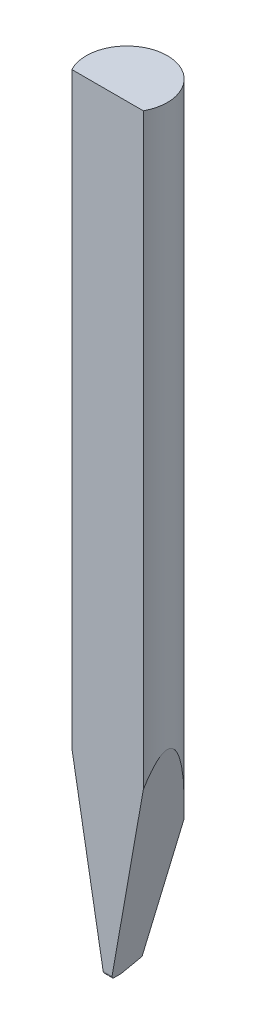
ISO-10303-21;
HEADER;
FILE_DESCRIPTION(('STEP AP214'),'2;1');
FILE_NAME('part.step','',(''),(''),'','','');
FILE_SCHEMA(('AUTOMOTIVE_DESIGN { 1 0 10303 214 1 1 1 1 }'));
ENDSEC;
DATA;
#1=APPLICATION_CONTEXT('core data for automotive mechanical design processes');
#2=APPLICATION_PROTOCOL_DEFINITION('international standard','automotive_design',2000,#1);
#3=PRODUCT_CONTEXT('',#1,'mechanical');
#4=PRODUCT('Part','Part','',(#3));
#5=PRODUCT_RELATED_PRODUCT_CATEGORY('part','',(#4));
#6=PRODUCT_DEFINITION_FORMATION('','',#4);
#7=PRODUCT_DEFINITION_CONTEXT('part definition',#1,'design');
#8=PRODUCT_DEFINITION('design','',#6,#7);
#9=PRODUCT_DEFINITION_SHAPE('','',#8);
#10=(LENGTH_UNIT() NAMED_UNIT(*) SI_UNIT(.MILLI.,.METRE.));
#11=(NAMED_UNIT(*) PLANE_ANGLE_UNIT() SI_UNIT($,.RADIAN.));
#12=(NAMED_UNIT(*) SI_UNIT($,.STERADIAN.) SOLID_ANGLE_UNIT());
#13=UNCERTAINTY_MEASURE_WITH_UNIT(LENGTH_MEASURE(1.E-05),#10,'distance_accuracy_value','');
#14=(GEOMETRIC_REPRESENTATION_CONTEXT(3) GLOBAL_UNCERTAINTY_ASSIGNED_CONTEXT((#13)) GLOBAL_UNIT_ASSIGNED_CONTEXT((#10,
#11,#12)) REPRESENTATION_CONTEXT('',''));
#15=CARTESIAN_POINT('',(0.,0.,0.));
#16=DIRECTION('',(0.,0.,1.));
#17=DIRECTION('',(1.,0.,0.));
#18=AXIS2_PLACEMENT_3D('',#15,#16,#17);
#19=CARTESIAN_POINT('',(0.,0.,0.));
#20=DIRECTION('',(0.,1.,0.));
#21=DIRECTION('',(0.,0.,1.));
#22=AXIS2_PLACEMENT_3D('',#19,#20,#21);
#23=PLANE('',#22);
#24=DIRECTION('',(0.,0.,-1.));
#25=VECTOR('',#24,1.);
#26=CARTESIAN_POINT('',(-0.0475000000000001,0.,0.10865));
#27=LINE('',#26,#25);
#28=CARTESIAN_POINT('',(-0.0475,0.,0.257439310229206));
#29=VERTEX_POINT('',#28);
#30=CARTESIAN_POINT('',(-0.0475,0.,0.1875));
#31=VERTEX_POINT('',#30);
#32=EDGE_CURVE('E352',#29,#31,#27,.T.);
#33=ORIENTED_EDGE('',*,*,#32,.F.);
#34=DIRECTION('',(-1.,0.,0.));
#35=VECTOR('',#34,1.);
#36=CARTESIAN_POINT('',(0.,0.,0.257439310229206));
#37=LINE('',#36,#35);
#38=CARTESIAN_POINT('',(-0.0255,0.,0.257439310229206));
#39=VERTEX_POINT('',#38);
#40=EDGE_CURVE('E338',#29,#39,#37,.F.);
#41=ORIENTED_EDGE('',*,*,#40,.T.);
#42=DIRECTION('',(0.,0.,-1.));
#43=VECTOR('',#42,1.);
#44=CARTESIAN_POINT('',(-0.0255,0.,-0.7935));
#45=LINE('',#44,#43);
#46=CARTESIAN_POINT('',(-0.0255,0.,0.3245));
#47=VERTEX_POINT('',#46);
#48=EDGE_CURVE('E272',#47,#39,#45,.T.);
#49=ORIENTED_EDGE('',*,*,#48,.F.);
#50=DIRECTION('',(-1.,0.,0.));
#51=VECTOR('',#50,1.);
#52=CARTESIAN_POINT('',(0.8025,0.,0.3245));
#53=LINE('',#52,#51);
#54=CARTESIAN_POINT('',(-0.0775,0.,0.3245));
#55=VERTEX_POINT('',#54);
#56=EDGE_CURVE('E432',#47,#55,#53,.T.);
#57=ORIENTED_EDGE('',*,*,#56,.T.);
#58=DIRECTION('',(0.,0.,-1.));
#59=VECTOR('',#58,1.);
#60=CARTESIAN_POINT('',(-0.0775,0.,0.8025));
#61=LINE('',#60,#59);
#62=CARTESIAN_POINT('',(-0.0775,0.,0.1875));
#63=VERTEX_POINT('',#62);
#64=EDGE_CURVE('E466',#55,#63,#61,.T.);
#65=ORIENTED_EDGE('',*,*,#64,.T.);
#66=DIRECTION('',(-1.,0.,0.));
#67=VECTOR('',#66,1.);
#68=CARTESIAN_POINT('',(0.8025,0.,0.1875));
#69=LINE('',#68,#67);
#70=EDGE_CURVE('E449',#31,#63,#69,.T.);
#71=ORIENTED_EDGE('',*,*,#70,.F.);
#72=EDGE_LOOP('',(#33,#41,#49,#57,#65,#71));
#73=FACE_BOUND('',#72,.T.);
#74=ADVANCED_FACE('F131',(#73),#23,.F.);
#75=DIRECTION('',(0.,0.,1.));
#76=VECTOR('',#75,1.);
#77=CARTESIAN_POINT('',(0.0255000000000001,0.,-0.7935));
#78=LINE('',#77,#76);
#79=CARTESIAN_POINT('',(0.0255000000000001,0.,0.257439310229206));
#80=VERTEX_POINT('',#79);
#81=CARTESIAN_POINT('',(0.0255000000000001,0.,0.3245));
#82=VERTEX_POINT('',#81);
#83=EDGE_CURVE('E277',#80,#82,#78,.T.);
#84=ORIENTED_EDGE('',*,*,#83,.F.);
#85=DIRECTION('',(-1.,0.,0.));
#86=VECTOR('',#85,1.);
#87=CARTESIAN_POINT('',(0.,0.,0.257439310229206));
#88=LINE('',#87,#86);
#89=CARTESIAN_POINT('',(0.0475,0.,0.257439310229206));
#90=VERTEX_POINT('',#89);
#91=EDGE_CURVE('E343',#80,#90,#88,.F.);
#92=ORIENTED_EDGE('',*,*,#91,.T.);
#93=DIRECTION('',(0.,0.,1.));
#94=VECTOR('',#93,1.);
#95=CARTESIAN_POINT('',(0.0475,0.,0.10865));
#96=LINE('',#95,#94);
#97=CARTESIAN_POINT('',(0.0475,0.,0.1875));
#98=VERTEX_POINT('',#97);
#99=EDGE_CURVE('E145',#98,#90,#96,.T.);
#100=ORIENTED_EDGE('',*,*,#99,.F.);
#101=CARTESIAN_POINT('',(0.0775000000000001,0.,0.1875));
#102=VERTEX_POINT('',#101);
#103=EDGE_CURVE('E450',#102,#98,#69,.T.);
#104=ORIENTED_EDGE('',*,*,#103,.F.);
#105=DIRECTION('',(0.,0.,-1.));
#106=VECTOR('',#105,1.);
#107=CARTESIAN_POINT('',(0.0775,0.,0.8025));
#108=LINE('',#107,#106);
#109=CARTESIAN_POINT('',(0.0774999999999998,0.,0.3245));
#110=VERTEX_POINT('',#109);
#111=EDGE_CURVE('E464',#110,#102,#108,.T.);
#112=ORIENTED_EDGE('',*,*,#111,.F.);
#113=EDGE_CURVE('E437',#110,#82,#53,.T.);
#114=ORIENTED_EDGE('',*,*,#113,.T.);
#115=EDGE_LOOP('',(#84,#92,#100,#104,#112,#114));
#116=FACE_BOUND('',#115,.T.);
#117=ADVANCED_FACE('F312',(#116),#23,.F.);
#118=CARTESIAN_POINT('',(0.8025,4.1116793192229,0.8025));
#119=DIRECTION('',(0.984807753012208,-0.173648177666928,0.));
#120=DIRECTION('',(0.173648177666928,0.984807753012209,0.));
#121=AXIS2_PLACEMENT_3D('',#118,#119,#120);
#122=PLANE('',#121);
#123=DIRECTION('',(0.173648177666928,0.984807753012209,0.));
#124=VECTOR('',#123,1.);
#125=CARTESIAN_POINT('',(2.61611582808828,14.397205792831,0.3755));
#126=LINE('',#125,#124);
#127=CARTESIAN_POINT('',(0.0864926760161312,0.0510000000000007,0.3755));
#128=VERTEX_POINT('',#127);
#129=CARTESIAN_POINT('',(0.697893974755478,3.51842907003117,0.3755));
#130=VERTEX_POINT('',#129);
#131=EDGE_CURVE('E484',#128,#130,#126,.T.);
#132=ORIENTED_EDGE('',*,*,#131,.F.);
#133=CARTESIAN_POINT('',(0.0864926760161314,0.051,0.3245));
#134=DIRECTION('',(0.984807753012208,-0.173648177666928,0.));
#135=DIRECTION('',(-0.173648177666928,-0.984807753012209,0.));
#136=AXIS2_PLACEMENT_3D('',#133,#134,#135);
#137=ELLIPSE('',#136,0.051786757206173,0.051);
#138=EDGE_CURVE('E446',#128,#110,#137,.T.);
#139=ORIENTED_EDGE('',*,*,#138,.T.);
#140=ORIENTED_EDGE('',*,*,#111,.T.);
#141=DIRECTION('',(0.0455893306574906,0.258549942126371,-0.964921520309633));
#142=VECTOR('',#141,1.);
#143=CARTESIAN_POINT('',(0.100417755598953,0.129973050674789,-0.29756602873305));
#144=LINE('',#143,#142);
#145=CARTESIAN_POINT('',(0.0958977476958887,0.104338812029609,-0.201897747695888));
#146=VERTEX_POINT('',#145);
#147=EDGE_CURVE('E456',#102,#146,#144,.T.);
#148=ORIENTED_EDGE('',*,*,#147,.T.);
#149=DIRECTION('',(0.171087869746033,0.970287525247816,-0.171087869746028));
#150=VECTOR('',#149,1.);
#151=CARTESIAN_POINT('',(0.752417217752885,3.82764574678896,-0.858417217752867));
#152=LINE('',#151,#150);
#153=CARTESIAN_POINT('',(0.504870168587644,2.4237366673581,-0.610870168587633));
#154=VERTEX_POINT('',#153);
#155=EDGE_CURVE('E461',#146,#154,#152,.T.);
#156=ORIENTED_EDGE('',*,*,#155,.T.);
#157=CARTESIAN_POINT('',(0.,-0.439524341020377,0.));
#158=DIRECTION('',(0.984807753012208,-0.173648177666928,0.));
#159=DIRECTION('',(-0.173648177666928,-0.984807753012209,0.));
#160=AXIS2_PLACEMENT_3D('',#157,#158,#159);
#161=ELLIPSE('',#160,4.5638256078914,0.7925);
#162=EDGE_CURVE('E468',#154,#130,#161,.T.);
#163=ORIENTED_EDGE('',*,*,#162,.T.);
#164=EDGE_LOOP('',(#132,#139,#140,#148,#156,#163));
#165=FACE_BOUND('',#164,.T.);
#166=ADVANCED_FACE('F318',(#165),#122,.T.);
#167=CARTESIAN_POINT('',(-0.0775,0.,0.8025));
#168=DIRECTION('',(-0.984807753012208,-0.173648177666928,0.));
#169=DIRECTION('',(0.173648177666928,-0.984807753012209,0.));
#170=AXIS2_PLACEMENT_3D('',#167,#168,#169);
#171=PLANE('',#170);
#172=ORIENTED_EDGE('',*,*,#64,.F.);
#173=CARTESIAN_POINT('',(-0.0864926760161316,0.051,0.3245));
#174=DIRECTION('',(-0.984807753012208,-0.173648177666928,0.));
#175=DIRECTION('',(-0.173648177666928,0.984807753012209,0.));
#176=AXIS2_PLACEMENT_3D('',#173,#174,#175);
#177=ELLIPSE('',#176,0.051786757206173,0.051);
#178=CARTESIAN_POINT('',(-0.0864926760161314,0.051,0.3755));
#179=VERTEX_POINT('',#178);
#180=EDGE_CURVE('E435',#55,#179,#177,.T.);
#181=ORIENTED_EDGE('',*,*,#180,.T.);
#182=DIRECTION('',(0.173648177666928,-0.984807753012209,0.));
#183=VECTOR('',#182,1.);
#184=CARTESIAN_POINT('',(-2.66451249990759,14.6716769578499,0.3755));
#185=LINE('',#184,#183);
#186=CARTESIAN_POINT('',(-0.697893974755478,3.51842907003117,0.3755));
#187=VERTEX_POINT('',#186);
#188=EDGE_CURVE('E486',#187,#179,#185,.T.);
#189=ORIENTED_EDGE('',*,*,#188,.F.);
#190=CARTESIAN_POINT('',(0.,-0.439524341020377,0.));
#191=DIRECTION('',(-0.984807753012208,-0.173648177666928,0.));
#192=DIRECTION('',(0.173648177666928,-0.984807753012209,0.));
#193=AXIS2_PLACEMENT_3D('',#190,#191,#192);
#194=ELLIPSE('',#193,4.5638256078914,0.7925);
#195=CARTESIAN_POINT('',(-0.504870168587645,2.4237366673581,-0.610870168587633));
#196=VERTEX_POINT('',#195);
#197=EDGE_CURVE('E471',#187,#196,#194,.T.);
#198=ORIENTED_EDGE('',*,*,#197,.T.);
#199=DIRECTION('',(0.171087869746033,-0.970287525247816,0.171087869746028));
#200=VECTOR('',#199,1.);
#201=CARTESIAN_POINT('',(-0.0486387356542045,-0.163680363775494,-0.154638735654206));
#202=LINE('',#201,#200);
#203=CARTESIAN_POINT('',(-0.0958977476958886,0.104338812029609,-0.201897747695889));
#204=VERTEX_POINT('',#203);
#205=EDGE_CURVE('E492',#196,#204,#202,.T.);
#206=ORIENTED_EDGE('',*,*,#205,.T.);
#207=DIRECTION('',(0.0455893306574906,-0.258549942126371,0.964921520309633));
#208=VECTOR('',#207,1.);
#209=CARTESIAN_POINT('',(-0.0504460723575265,-0.153430447988015,0.760110227319341));
#210=LINE('',#209,#208);
#211=EDGE_CURVE('E489',#204,#63,#210,.T.);
#212=ORIENTED_EDGE('',*,*,#211,.T.);
#213=EDGE_LOOP('',(#172,#181,#189,#198,#206,#212));
#214=FACE_BOUND('',#213,.T.);
#215=ADVANCED_FACE('F561',(#214),#171,.T.);
#216=CARTESIAN_POINT('',(-0.8025,15.,0.3755));
#217=DIRECTION('',(0.,0.,1.));
#218=DIRECTION('',(1.,0.,0.));
#219=AXIS2_PLACEMENT_3D('',#216,#217,#218);
#220=PLANE('',#219);
#221=ORIENTED_EDGE('',*,*,#188,.T.);
#222=DIRECTION('',(1.,0.,0.));
#223=VECTOR('',#222,1.);
#224=CARTESIAN_POINT('',(-0.8025,0.0510000000000007,0.3755));
#225=LINE('',#224,#223);
#226=EDGE_CURVE('E495',#179,#128,#225,.T.);
#227=ORIENTED_EDGE('',*,*,#226,.T.);
#228=ORIENTED_EDGE('',*,*,#131,.T.);
#229=DIRECTION('',(0.,-1.,0.));
#230=VECTOR('',#229,1.);
#231=CARTESIAN_POINT('',(0.697893974755478,15.,0.3755));
#232=LINE('',#231,#230);
#233=CARTESIAN_POINT('',(0.697893974755478,15.,0.3755));
#234=VERTEX_POINT('',#233);
#235=EDGE_CURVE('E476',#130,#234,#232,.F.);
#236=ORIENTED_EDGE('',*,*,#235,.T.);
#237=DIRECTION('',(-1.,0.,0.));
#238=VECTOR('',#237,1.);
#239=CARTESIAN_POINT('',(-0.8025,15.,0.3755));
#240=LINE('',#239,#238);
#241=CARTESIAN_POINT('',(-0.697893974755478,15.,0.3755));
#242=VERTEX_POINT('',#241);
#243=EDGE_CURVE('E474',#234,#242,#240,.T.);
#244=ORIENTED_EDGE('',*,*,#243,.T.);
#245=DIRECTION('',(0.,-1.,0.));
#246=VECTOR('',#245,1.);
#247=CARTESIAN_POINT('',(-0.697893974755478,15.,0.3755));
#248=LINE('',#247,#246);
#249=EDGE_CURVE('E478',#242,#187,#248,.T.);
#250=ORIENTED_EDGE('',*,*,#249,.T.);
#251=EDGE_LOOP('',(#221,#227,#228,#236,#244,#250));
#252=FACE_BOUND('',#251,.T.);
#253=ADVANCED_FACE('F326',(#252),#220,.T.);
#254=CARTESIAN_POINT('',(0.,15.,0.));
#255=DIRECTION('',(0.,-1.,0.));
#256=DIRECTION('',(0.,0.,-1.));
#257=AXIS2_PLACEMENT_3D('',#254,#255,#256);
#258=CYLINDRICAL_SURFACE('',#257,0.7925);
#259=CARTESIAN_POINT('',(0.,-1.0406802138999,0.));
#260=DIRECTION('',(0.,-0.173648177666923,-0.984807753012209));
#261=DIRECTION('',(0.,-0.984807753012209,0.173648177666923));
#262=AXIS2_PLACEMENT_3D('',#259,#260,#261);
#263=ELLIPSE('',#262,4.56382560789152,0.7925);
#264=EDGE_CURVE('E459',#196,#154,#263,.T.);
#265=ORIENTED_EDGE('',*,*,#264,.F.);
#266=ORIENTED_EDGE('',*,*,#197,.F.);
#267=ORIENTED_EDGE('',*,*,#249,.F.);
#268=CARTESIAN_POINT('',(0.,15.,0.));
#269=DIRECTION('',(0.,1.,0.));
#270=DIRECTION('',(0.,0.,1.));
#271=AXIS2_PLACEMENT_3D('',#268,#269,#270);
#272=CIRCLE('',#271,0.7925);
#273=EDGE_CURVE('E481',#234,#242,#272,.T.);
#274=ORIENTED_EDGE('',*,*,#273,.F.);
#275=ORIENTED_EDGE('',*,*,#235,.F.);
#276=ORIENTED_EDGE('',*,*,#162,.F.);
#277=EDGE_LOOP('',(#265,#266,#267,#274,#275,#276));
#278=FACE_BOUND('',#277,.T.);
#279=ADVANCED_FACE('F324',(#278),#258,.T.);
#280=CARTESIAN_POINT('',(0.,15.,0.));
#281=DIRECTION('',(0.,1.,0.));
#282=DIRECTION('',(0.,0.,1.));
#283=AXIS2_PLACEMENT_3D('',#280,#281,#282);
#284=PLANE('',#283);
#285=ORIENTED_EDGE('',*,*,#273,.T.);
#286=ORIENTED_EDGE('',*,*,#243,.F.);
#287=EDGE_LOOP('',(#285,#286));
#288=FACE_BOUND('',#287,.T.);
#289=ADVANCED_FACE('F322',(#288),#284,.T.);
#290=CARTESIAN_POINT('',(0.8025,0.104338812029609,-0.201897747695888));
#291=DIRECTION('',(0.,-0.173648177666923,-0.984807753012209));
#292=DIRECTION('',(0.,0.984807753012209,-0.173648177666923));
#293=AXIS2_PLACEMENT_3D('',#290,#291,#292);
#294=PLANE('',#293);
#295=CARTESIAN_POINT('',(0.,0.603593196235099,-0.289929765868303));
#296=DIRECTION('',(0.,-0.173648177666923,-0.984807753012209));
#297=DIRECTION('',(0.,0.984807753012209,-0.173648177666923));
#298=AXIS2_PLACEMENT_3D('',#295,#296,#297);
#299=ELLIPSE('',#298,0.25750528005028,0.119084095903733);
#300=CARTESIAN_POINT('',(0.,0.857186392470194,-0.334645088488644));
#301=VERTEX_POINT('',#300);
#302=EDGE_CURVE('E364',#301,#301,#299,.T.);
#303=ORIENTED_EDGE('',*,*,#302,.F.);
#304=EDGE_LOOP('',(#303));
#305=FACE_BOUND('',#304,.T.);
#306=DIRECTION('',(-1.,0.,0.));
#307=VECTOR('',#306,1.);
#308=CARTESIAN_POINT('',(0.8025,0.104338812029609,-0.201897747695888));
#309=LINE('',#308,#307);
#310=EDGE_CURVE('E453',#146,#204,#309,.T.);
#311=ORIENTED_EDGE('',*,*,#310,.T.);
#312=ORIENTED_EDGE('',*,*,#205,.F.);
#313=ORIENTED_EDGE('',*,*,#264,.T.);
#314=ORIENTED_EDGE('',*,*,#155,.F.);
#315=EDGE_LOOP('',(#311,#312,#313,#314));
#316=FACE_BOUND('',#315,.T.);
#317=ADVANCED_FACE('F555',(#305,#316),#294,.T.);
#318=CARTESIAN_POINT('',(0.8025,0.,0.1875));
#319=DIRECTION('',(0.,-0.96592582628907,-0.258819045102515));
#320=DIRECTION('',(0.,0.258819045102515,-0.96592582628907));
#321=AXIS2_PLACEMENT_3D('',#318,#319,#320);
#322=PLANE('',#321);
#323=DIRECTION('',(0.,0.258819045102515,-0.96592582628907));
#324=VECTOR('',#323,1.);
#325=CARTESIAN_POINT('',(-0.0474999999999999,0.,0.1875));
#326=LINE('',#325,#324);
#327=CARTESIAN_POINT('',(-0.0475000000000001,0.0551171488830805,-0.0182));
#328=VERTEX_POINT('',#327);
#329=EDGE_CURVE('E375',#31,#328,#326,.T.);
#330=ORIENTED_EDGE('',*,*,#329,.F.);
#331=ORIENTED_EDGE('',*,*,#70,.T.);
#332=ORIENTED_EDGE('',*,*,#211,.F.);
#333=ORIENTED_EDGE('',*,*,#310,.F.);
#334=ORIENTED_EDGE('',*,*,#147,.F.);
#335=ORIENTED_EDGE('',*,*,#103,.T.);
#336=DIRECTION('',(0.,-0.258819045102515,0.96592582628907));
#337=VECTOR('',#336,1.);
#338=CARTESIAN_POINT('',(0.0474999999999999,0.,0.1875));
#339=LINE('',#338,#337);
#340=CARTESIAN_POINT('',(0.0475,0.0551171488830805,-0.0182));
#341=VERTEX_POINT('',#340);
#342=EDGE_CURVE('E498',#341,#98,#339,.T.);
#343=ORIENTED_EDGE('',*,*,#342,.F.);
#344=DIRECTION('',(1.,0.,0.));
#345=VECTOR('',#344,1.);
#346=CARTESIAN_POINT('',(0.8025,0.0551171488830805,-0.0182));
#347=LINE('',#346,#345);
#348=EDGE_CURVE('E499',#328,#341,#347,.T.);
#349=ORIENTED_EDGE('',*,*,#348,.F.);
#350=EDGE_LOOP('',(#330,#331,#332,#333,#334,#335,#343,#349));
#351=FACE_BOUND('',#350,.T.);
#352=ADVANCED_FACE('F515',(#351),#322,.T.);
#353=CARTESIAN_POINT('',(0.8025,0.051,0.3245));
#354=DIRECTION('',(-1.,0.,0.));
#355=DIRECTION('',(0.,0.,1.));
#356=AXIS2_PLACEMENT_3D('',#353,#354,#355);
#357=CYLINDRICAL_SURFACE('',#356,0.051);
#358=CARTESIAN_POINT('',(-0.00171830943409526,0.051,0.3245));
#359=DIRECTION('',(-0.906307787036651,0.422618261740697,0.));
#360=DIRECTION('',(-0.422618261740697,-0.906307787036651,0.));
#361=AXIS2_PLACEMENT_3D('',#358,#359,#360);
#362=ELLIPSE('',#361,0.056272273867087,0.051);
#363=CARTESIAN_POINT('',(-0.0143852986017202,0.0238355540680084,0.367663559598438));
#364=VERTEX_POINT('',#363);
#365=EDGE_CURVE('E284',#47,#364,#362,.T.);
#366=ORIENTED_EDGE('',*,*,#365,.T.);
#367=CARTESIAN_POINT('',(-0.0143852986017201,0.0238355540680084,0.367663559598438));
#368=CARTESIAN_POINT('',(-0.0140488024893387,0.0245599728875085,0.368120330125));
#369=CARTESIAN_POINT('',(-0.0136469823715301,0.0252761590346725,0.368544702556877));
#370=CARTESIAN_POINT('',(-0.0127157760141209,0.0266634537717098,0.369325752032183));
#371=CARTESIAN_POINT('',(-0.0121861099480505,0.0273344592929303,0.369682277469204));
#372=CARTESIAN_POINT('',(-0.0110017272996389,0.0286015476427805,0.370323813508433));
#373=CARTESIAN_POINT('',(-0.0103465755008802,0.0291973573780401,0.370608566983727));
#374=CARTESIAN_POINT('',(-0.00892931897366891,0.0302803081885538,0.371105246034449));
#375=CARTESIAN_POINT('',(-0.00816738633120438,0.0307676209074657,0.371317286933398));
#376=CARTESIAN_POINT('',(-0.00661142196689859,0.0315824690415379,0.371660824038474));
#377=CARTESIAN_POINT('',(-0.00582269948958903,0.0319183337598971,0.371796661246428));
#378=CARTESIAN_POINT('',(-0.00419400373586091,0.0324599158631989,0.372011586808007));
#379=CARTESIAN_POINT('',(-0.00335401105521102,0.0326655836334157,0.372090653529391));
#380=CARTESIAN_POINT('',(-0.00167394162120721,0.0329337176823904,0.37219307618541));
#381=CARTESIAN_POINT('',(-0.000834607436282753,0.0330002533270435,0.372218016090317));
#382=CARTESIAN_POINT('',(0.000843851956455435,0.0329997453285332,0.372217825731411));
#383=CARTESIAN_POINT('',(0.00168297716720856,0.0329327329412131,0.372192707183377));
#384=CARTESIAN_POINT('',(0.00333320676255795,0.0326684440640425,0.372091739020442));
#385=CARTESIAN_POINT('',(0.00414442475834964,0.0324717842215133,0.372016129535638));
#386=CARTESIAN_POINT('',(0.00572009442136969,0.0319566442994558,0.371812015118309));
#387=CARTESIAN_POINT('',(0.00648454891433118,0.0316381715890471,0.371683513385488));
#388=CARTESIAN_POINT('',(0.00794846664448581,0.0308910568930543,0.37136997241993));
#389=CARTESIAN_POINT('',(0.0086476870228246,0.0304620239820663,0.371184732120017));
#390=CARTESIAN_POINT('',(0.0099604933900658,0.029512204985364,0.370755219298662));
#391=CARTESIAN_POINT('',(0.0105740571866019,0.0289913952003807,0.370510931523496));
#392=CARTESIAN_POINT('',(0.0117160814376734,0.0278665298179182,0.369955965582428));
#393=CARTESIAN_POINT('',(0.0122421796402759,0.0272607934847157,0.369643850856636));
#394=CARTESIAN_POINT('',(0.0131836945923898,0.02600120294203,0.368958643617409));
#395=CARTESIAN_POINT('',(0.0135992226344418,0.025347397967944,0.368585613032941));
#396=CARTESIAN_POINT('',(0.0141112867742827,0.0244013659626461,0.368015773871397));
#397=CARTESIAN_POINT('',(0.0142531744217309,0.0241190717637415,0.367842055288229));
#398=CARTESIAN_POINT('',(0.0143852986017204,0.0238355540680085,0.367663559598438));
#399=B_SPLINE_CURVE_WITH_KNOTS('',3,(#367,#368,#369,#370,#371,#372,#373,#374,#375,#376,#377,
#378,#379,#380,#381,#382,#383,#384,#385,#386,#387,#388,#389,#390,#391,#392,#393,#394,#395,#396,
#397,#398),.UNSPECIFIED.,.F.,.F.,(4,2,2,2,2,2,2,2,2,2,2,2,2,2,2,4),(0.,0.00275970931888948,
0.00552551469658797,0.00830109221832556,0.0110722470378698,0.0136631999167849,
0.0162551395481397,0.0187701441019566,0.0212845601083016,0.0237871021579743,0.026289492839271,
0.0288008560207815,0.0313128686569765,0.0338844307334143,0.036453394571599,0.0375342516796701),.UNSPECIFIED.);
#400=CARTESIAN_POINT('',(0.0143852986017204,0.0238355540680084,0.367663559598438));
#401=VERTEX_POINT('',#400);
#402=EDGE_CURVE('E266',#364,#401,#399,.T.);
#403=ORIENTED_EDGE('',*,*,#402,.T.);
#404=CARTESIAN_POINT('',(0.00171830943409537,0.051,0.3245));
#405=DIRECTION('',(0.906307787036652,0.422618261740695,0.));
#406=DIRECTION('',(-0.422618261740695,0.906307787036652,0.));
#407=AXIS2_PLACEMENT_3D('',#404,#405,#406);
#408=ELLIPSE('',#407,0.056272273867087,0.051);
#409=EDGE_CURVE('E275',#401,#82,#408,.T.);
#410=ORIENTED_EDGE('',*,*,#409,.T.);
#411=ORIENTED_EDGE('',*,*,#113,.F.);
#412=ORIENTED_EDGE('',*,*,#138,.F.);
#413=ORIENTED_EDGE('',*,*,#226,.F.);
#414=ORIENTED_EDGE('',*,*,#180,.F.);
#415=ORIENTED_EDGE('',*,*,#56,.F.);
#416=EDGE_LOOP('',(#366,#403,#410,#411,#412,#413,#414,#415));
#417=FACE_BOUND('',#416,.T.);
#418=ADVANCED_FACE('F282',(#417),#357,.T.);
#419=CARTESIAN_POINT('',(-0.0475,0.2083,0.115237938927801));
#420=DIRECTION('',(-1.,0.,0.));
#421=DIRECTION('',(0.,0.,-1.));
#422=AXIS2_PLACEMENT_3D('',#419,#420,#421);
#423=PLANE('',#422);
#424=ORIENTED_EDGE('',*,*,#329,.T.);
#425=DIRECTION('',(0.,-1.,0.));
#426=VECTOR('',#425,1.);
#427=CARTESIAN_POINT('',(-0.0475,0.10415,-0.0182));
#428=LINE('',#427,#426);
#429=CARTESIAN_POINT('',(-0.0474999999999999,0.2083,-0.0181999999999999));
#430=VERTEX_POINT('',#429);
#431=EDGE_CURVE('E441',#430,#328,#428,.T.);
#432=ORIENTED_EDGE('',*,*,#431,.F.);
#433=DIRECTION('',(0.,0.,-1.));
#434=VECTOR('',#433,1.);
#435=CARTESIAN_POINT('',(-0.0474999999999999,0.2083,0.0485189694639005));
#436=LINE('',#435,#434);
#437=CARTESIAN_POINT('',(-0.0475,0.2083,0.115237938927801));
#438=VERTEX_POINT('',#437);
#439=EDGE_CURVE('E438',#438,#430,#436,.T.);
#440=ORIENTED_EDGE('',*,*,#439,.F.);
#441=DIRECTION('',(0.,-0.866025403784438,0.5));
#442=VECTOR('',#441,1.);
#443=CARTESIAN_POINT('',(-0.0475,0.10415,0.1753689694639));
#444=LINE('',#443,#442);
#445=CARTESIAN_POINT('',(-0.0475,0.019,0.224530344885397));
#446=VERTEX_POINT('',#445);
#447=EDGE_CURVE('E356',#438,#446,#444,.T.);
#448=ORIENTED_EDGE('',*,*,#447,.T.);
#449=CARTESIAN_POINT('',(-0.0475,0.038,0.257439310229206));
#450=DIRECTION('',(-1.,0.,0.));
#451=DIRECTION('',(0.,-1.,0.));
#452=AXIS2_PLACEMENT_3D('',#449,#450,#451);
#453=CIRCLE('',#452,0.038);
#454=EDGE_CURVE('E139',#446,#29,#453,.T.);
#455=ORIENTED_EDGE('',*,*,#454,.T.);
#456=ORIENTED_EDGE('',*,*,#32,.T.);
#457=EDGE_LOOP('',(#424,#432,#440,#448,#455,#456));
#458=FACE_BOUND('',#457,.T.);
#459=ADVANCED_FACE('F351',(#458),#423,.F.);
#460=CARTESIAN_POINT('',(-0.0474999999999999,0.2083,-0.0181999999999999));
#461=DIRECTION('',(0.,0.,-1.));
#462=DIRECTION('',(1.,0.,0.));
#463=AXIS2_PLACEMENT_3D('',#460,#461,#462);
#464=PLANE('',#463);
#465=DIRECTION('',(1.,0.,0.));
#466=VECTOR('',#465,1.);
#467=CARTESIAN_POINT('',(0.,0.2083,-0.0181999999999999));
#468=LINE('',#467,#466);
#469=CARTESIAN_POINT('',(0.0440035521185948,0.2083,-0.0181999999999999));
#470=VERTEX_POINT('',#469);
#471=CARTESIAN_POINT('',(0.0475000000000001,0.2083,-0.0181999999999999));
#472=VERTEX_POINT('',#471);
#473=EDGE_CURVE('E524',#470,#472,#468,.T.);
#474=ORIENTED_EDGE('',*,*,#473,.F.);
#475=CARTESIAN_POINT('',(0.0440035521185948,0.2083,-0.0182));
#476=CARTESIAN_POINT('',(0.044041094632544,0.203553520905426,-0.0182000000066655));
#477=CARTESIAN_POINT('',(0.0437046311561487,0.198804662564968,-0.0182000000033492));
#478=CARTESIAN_POINT('',(0.0422284372335924,0.189387148386334,-0.0181999999966175));
#479=CARTESIAN_POINT('',(0.0410807725704541,0.184719755238304,-0.0181999999932015));
#480=CARTESIAN_POINT('',(0.0372699496378715,0.173769677668476,-0.0182000000096165));
#481=CARTESIAN_POINT('',(0.0341757899722838,0.16761940035534,-0.0182000000396708));
#482=CARTESIAN_POINT('',(0.0270779301790117,0.158239055129659,-0.0181999999710665));
#483=CARTESIAN_POINT('',(0.0235470802641946,0.154669154088338,-0.018199999905044));
#484=CARTESIAN_POINT('',(0.016187513488713,0.149561906011676,-0.0181999999170066));
#485=CARTESIAN_POINT('',(0.0125475418396446,0.147765355370848,-0.0181999999696765));
#486=CARTESIAN_POINT('',(0.00481655173130606,0.145579537212843,-0.0182000000146689));
#487=CARTESIAN_POINT('',(0.000723365567176382,0.145197362953677,-0.0182000000066878));
#488=CARTESIAN_POINT('',(-0.00682037846047253,0.145982594216989,-0.0181999999940811));
#489=CARTESIAN_POINT('',(-0.0102907113200617,0.146976877412656,-0.018199999989175));
#490=CARTESIAN_POINT('',(-0.0168820283411047,0.149986356486763,-0.0181999999898636));
#491=CARTESIAN_POINT('',(-0.0199857551231244,0.152037306385451,-0.018199999995846));
#492=CARTESIAN_POINT('',(-0.0271366152762053,0.158142071768032,-0.0181999999914794));
#493=CARTESIAN_POINT('',(-0.0307609389729885,0.16267676121693,-0.0181999999703127));
#494=CARTESIAN_POINT('',(-0.03772131463206,0.174317292538489,-0.0181999999304882));
#495=CARTESIAN_POINT('',(-0.0404592123609631,0.181754888020512,-0.0181999999156278));
#496=CARTESIAN_POINT('',(-0.0434232971104274,0.195648572535955,-0.0181999999313642));
#497=CARTESIAN_POINT('',(-0.0440266670295806,0.202024152992847,-0.0181999999538931));
#498=CARTESIAN_POINT('',(-0.0440035521807021,0.208299999999826,-0.0182000000001144));
#499=B_SPLINE_CURVE_WITH_KNOTS('',3,(#475,#476,#477,#478,#479,#480,#481,#482,#483,#484,#485,
#486,#487,#488,#489,#490,#491,#492,#493,#494,#495,#496,#497,#498),.UNSPECIFIED.,.F.,.F.,(4,2,2,
2,2,2,2,2,2,2,2,4),(0.,0.0142184593086259,0.0285779464350765,0.0488896917058201,
0.063703815633228,0.0756611669770367,0.087678405153631,0.0983138672458592,0.109335453189143,
0.126431410723606,0.149825905760428,0.168794562270624),.UNSPECIFIED.);
#500=CARTESIAN_POINT('',(-0.0440035521807013,0.2083,-0.0181999999999999));
#501=VERTEX_POINT('',#500);
#502=EDGE_CURVE('E367',#470,#501,#499,.T.);
#503=ORIENTED_EDGE('',*,*,#502,.T.);
#504=EDGE_CURVE('E513',#430,#501,#468,.T.);
#505=ORIENTED_EDGE('',*,*,#504,.F.);
#506=ORIENTED_EDGE('',*,*,#431,.T.);
#507=ORIENTED_EDGE('',*,*,#348,.T.);
#508=DIRECTION('',(0.,-1.,0.));
#509=VECTOR('',#508,1.);
#510=CARTESIAN_POINT('',(0.0475,0.10415,-0.0182));
#511=LINE('',#510,#509);
#512=EDGE_CURVE('E520',#472,#341,#511,.T.);
#513=ORIENTED_EDGE('',*,*,#512,.F.);
#514=EDGE_LOOP('',(#474,#503,#505,#506,#507,#513));
#515=FACE_BOUND('',#514,.T.);
#516=ADVANCED_FACE('F510',(#515),#464,.F.);
#517=CARTESIAN_POINT('',(0.0475000000000001,0.2083,-0.0181999999999999));
#518=DIRECTION('',(1.,0.,0.));
#519=DIRECTION('',(0.,0.,1.));
#520=AXIS2_PLACEMENT_3D('',#517,#518,#519);
#521=PLANE('',#520);
#522=ORIENTED_EDGE('',*,*,#342,.T.);
#523=ORIENTED_EDGE('',*,*,#99,.T.);
#524=CARTESIAN_POINT('',(0.0474999999999999,0.038,0.257439310229206));
#525=DIRECTION('',(1.,0.,0.));
#526=DIRECTION('',(0.,1.,0.));
#527=AXIS2_PLACEMENT_3D('',#524,#525,#526);
#528=CIRCLE('',#527,0.038);
#529=CARTESIAN_POINT('',(0.0475,0.019,0.224530344885397));
#530=VERTEX_POINT('',#529);
#531=EDGE_CURVE('E12',#90,#530,#528,.T.);
#532=ORIENTED_EDGE('',*,*,#531,.T.);
#533=DIRECTION('',(0.,-0.866025403784438,0.5));
#534=VECTOR('',#533,1.);
#535=CARTESIAN_POINT('',(0.0475,0.10415,0.1753689694639));
#536=LINE('',#535,#534);
#537=CARTESIAN_POINT('',(0.0475,0.2083,0.115237938927801));
#538=VERTEX_POINT('',#537);
#539=EDGE_CURVE('E534',#538,#530,#536,.T.);
#540=ORIENTED_EDGE('',*,*,#539,.F.);
#541=DIRECTION('',(0.,0.,1.));
#542=VECTOR('',#541,1.);
#543=CARTESIAN_POINT('',(0.0475,0.2083,0.0485189694639005));
#544=LINE('',#543,#542);
#545=EDGE_CURVE('E531',#472,#538,#544,.T.);
#546=ORIENTED_EDGE('',*,*,#545,.F.);
#547=ORIENTED_EDGE('',*,*,#512,.T.);
#548=EDGE_LOOP('',(#522,#523,#532,#540,#546,#547));
#549=FACE_BOUND('',#548,.T.);
#550=ADVANCED_FACE('F518',(#549),#521,.F.);
#551=CARTESIAN_POINT('',(0.0475,0.2083,0.115237938927801));
#552=DIRECTION('',(0.,0.5,0.866025403784438));
#553=DIRECTION('',(-1.,0.,0.));
#554=AXIS2_PLACEMENT_3D('',#551,#552,#553);
#555=PLANE('',#554);
#556=DIRECTION('',(0.374453581814995,0.803018297611854,-0.4636228302904));
#557=VECTOR('',#556,1.);
#558=CARTESIAN_POINT('',(0.149059569840535,0.374344205564202,0.0193722721479315));
#559=LINE('',#558,#557);
#560=CARTESIAN_POINT('',(-0.0166401544950551,0.019,0.224530344885397));
#561=VERTEX_POINT('',#560);
#562=CARTESIAN_POINT('',(-0.0143852986017202,0.0238355540680084,0.221738536442551));
#563=VERTEX_POINT('',#562);
#564=EDGE_CURVE('E285',#561,#563,#559,.T.);
#565=ORIENTED_EDGE('',*,*,#564,.F.);
#566=DIRECTION('',(-1.,0.,0.));
#567=VECTOR('',#566,1.);
#568=CARTESIAN_POINT('',(0.0475,0.0189999999999999,0.224530344885397));
#569=LINE('',#568,#567);
#570=EDGE_CURVE('E340',#561,#446,#569,.T.);
#571=ORIENTED_EDGE('',*,*,#570,.T.);
#572=ORIENTED_EDGE('',*,*,#447,.F.);
#573=DIRECTION('',(-1.,0.,0.));
#574=VECTOR('',#573,1.);
#575=CARTESIAN_POINT('',(0.,0.2083,0.115237938927801));
#576=LINE('',#575,#574);
#577=EDGE_CURVE('E537',#538,#438,#576,.T.);
#578=ORIENTED_EDGE('',*,*,#577,.F.);
#579=ORIENTED_EDGE('',*,*,#539,.T.);
#580=DIRECTION('',(-1.,0.,0.));
#581=VECTOR('',#580,1.);
#582=CARTESIAN_POINT('',(0.0475,0.0189999999999999,0.224530344885397));
#583=LINE('',#582,#581);
#584=CARTESIAN_POINT('',(0.0166401544950552,0.0189999999999999,0.224530344885397));
#585=VERTEX_POINT('',#584);
#586=EDGE_CURVE('E359',#530,#585,#583,.T.);
#587=ORIENTED_EDGE('',*,*,#586,.T.);
#588=DIRECTION('',(0.374453581814993,-0.803018297611855,0.4636228302904));
#589=VECTOR('',#588,1.);
#590=CARTESIAN_POINT('',(-0.161865420426759,0.401806440769372,0.00351694325967725));
#591=LINE('',#590,#589);
#592=CARTESIAN_POINT('',(0.0143852986017204,0.0238355540680083,0.221738536442552));
#593=VERTEX_POINT('',#592);
#594=EDGE_CURVE('E428',#593,#585,#591,.T.);
#595=ORIENTED_EDGE('',*,*,#594,.F.);
#596=CARTESIAN_POINT('',(0.,0.0171275791651799,0.225611387558417));
#597=DIRECTION('',(0.,0.5,0.866025403784438));
#598=DIRECTION('',(0.,-0.866025403784438,0.5));
#599=AXIS2_PLACEMENT_3D('',#596,#597,#598);
#600=ELLIPSE('',#599,0.0183278928833489,0.0158724208348201);
#601=EDGE_CURVE('E269',#563,#593,#600,.F.);
#602=ORIENTED_EDGE('',*,*,#601,.F.);
#603=EDGE_LOOP('',(#565,#571,#572,#578,#579,#587,#595,#602));
#604=FACE_BOUND('',#603,.T.);
#605=ADVANCED_FACE('F358',(#604),#555,.F.);
#606=CARTESIAN_POINT('',(0.,0.2083,0.));
#607=DIRECTION('',(0.,-1.,0.));
#608=DIRECTION('',(0.,0.,-1.));
#609=AXIS2_PLACEMENT_3D('',#606,#607,#608);
#610=PLANE('',#609);
#611=CARTESIAN_POINT('',(0.0440035521185948,0.2083,-0.0182));
#612=CARTESIAN_POINT('',(0.0440272261762745,0.208300000058283,-0.013401006061727));
#613=CARTESIAN_POINT('',(0.0436846284106066,0.208300000037763,-0.00859484690203671));
#614=CARTESIAN_POINT('',(0.0421850482141618,0.208299999961856,0.000935652007510193));
#615=CARTESIAN_POINT('',(0.0410198832702711,0.208299999906119,0.00565867683799134));
#616=CARTESIAN_POINT('',(0.0371731396724653,0.208299999882569,0.0165736321884355));
#617=CARTESIAN_POINT('',(0.0340824524001226,0.208299999956448,0.0226379458587908));
#618=CARTESIAN_POINT('',(0.0269622224902766,0.2083000000325,0.0319734464377846));
#619=CARTESIAN_POINT('',(0.0233699765022808,0.208300000048112,0.0355629074734538));
#620=CARTESIAN_POINT('',(0.0159698211108425,0.208299999962023,0.0406396779441715));
#621=CARTESIAN_POINT('',(0.0123667496999345,0.208299999884342,0.0424105317556987));
#622=CARTESIAN_POINT('',(0.00471432766206668,0.208299999859735,0.0445426087383378));
#623=CARTESIAN_POINT('',(0.000662691752019381,0.208299999913513,0.0448962368324433));
#624=CARTESIAN_POINT('',(-0.00681286445684046,0.208299999972125,0.0441071557684925));
#625=CARTESIAN_POINT('',(-0.0102562264515506,0.208299999981771,0.0431277962054972));
#626=CARTESIAN_POINT('',(-0.0168810968222872,0.208299999993543,0.0401314628014099));
#627=CARTESIAN_POINT('',(-0.0200354389237559,0.208299999995194,0.0380570516103822));
#628=CARTESIAN_POINT('',(-0.0271840315478029,0.208299999993619,0.0319318586329419));
#629=CARTESIAN_POINT('',(-0.0307638069582779,0.208299999987415,0.027414159246989));
#630=CARTESIAN_POINT('',(-0.0377403987809623,0.20829999998351,0.0157156838033812));
#631=CARTESIAN_POINT('',(-0.0405086227790674,0.208299999990123,0.00818720319332361));
#632=CARTESIAN_POINT('',(-0.0434446378913494,0.208299999999461,-0.00571634548367584));
#633=CARTESIAN_POINT('',(-0.0440356905101609,0.208300000002708,-0.0120026698343221));
#634=CARTESIAN_POINT('',(-0.0440035521807013,0.2083,-0.0181999999999971));
#635=B_SPLINE_CURVE_WITH_KNOTS('',3,(#611,#612,#613,#614,#615,#616,#617,#618,#619,#620,#621,
#622,#623,#624,#625,#626,#627,#628,#629,#630,#631,#632,#633,#634),.UNSPECIFIED.,.F.,.F.,(4,2,2,
2,2,2,2,2,2,2,2,4),(0.,0.0143859535264603,0.0289170657970887,0.0489959110194268,
0.0639793036819015,0.0758063732322586,0.0876967413387597,0.0982537458598321,0.109429347773037,
0.126408440981697,0.150081798006479,0.168796098475232),.UNSPECIFIED.);
#636=EDGE_CURVE('E361',#470,#501,#635,.T.);
#637=ORIENTED_EDGE('',*,*,#636,.F.);
#638=ORIENTED_EDGE('',*,*,#473,.T.);
#639=ORIENTED_EDGE('',*,*,#545,.T.);
#640=ORIENTED_EDGE('',*,*,#577,.T.);
#641=ORIENTED_EDGE('',*,*,#439,.T.);
#642=ORIENTED_EDGE('',*,*,#504,.T.);
#643=EDGE_LOOP('',(#637,#638,#639,#640,#641,#642));
#644=FACE_BOUND('',#643,.T.);
#645=ADVANCED_FACE('F377',(#644),#610,.T.);
#646=CARTESIAN_POINT('',(-0.00963336261925728,0.193411702486574,0.0581284811742004));
#647=CARTESIAN_POINT('',(-0.00963336261925728,0.261223742204415,-0.0096835585436403));
#648=CARTESIAN_POINT('',(0.010279535465876,0.328442995161986,-0.07711259567095));
#649=CARTESIAN_POINT('',(0.010279535465876,0.396255034879826,-0.144924635388791));
#650=CARTESIAN_POINT('',(-0.00843447149568419,0.193599679662266,0.0583164583498922));
#651=CARTESIAN_POINT('',(-0.00843447149568419,0.261411719380106,-0.00949558136794846));
#652=CARTESIAN_POINT('',(0.011474333041091,0.328242409123582,-0.0773131817093534));
#653=CARTESIAN_POINT('',(0.011474333041091,0.396054448841423,-0.145125221427194));
#654=CARTESIAN_POINT('',(-0.00603766078092491,0.193903271594079,0.0586200502817061));
#655=CARTESIAN_POINT('',(-0.00603766078092491,0.261715325222881,-0.00919200334709559));
#656=CARTESIAN_POINT('',(0.0138184203160564,0.327776405635563,-0.0777791573754516));
#657=CARTESIAN_POINT('',(0.0138184203160564,0.395588459264364,-0.145591211004253));
#658=CARTESIAN_POINT('',(-0.00245906361501495,0.194147745140675,0.058864523828302));
#659=CARTESIAN_POINT('',(-0.00245906361501495,0.261959827918539,-0.00894755894956158));
#660=CARTESIAN_POINT('',(0.0171895029286827,0.326892720918794,-0.0786627837940962));
#661=CARTESIAN_POINT('',(0.0171895029286827,0.394704803696657,-0.14647486657196));
#662=CARTESIAN_POINT('',(0.0010892103355977,0.194187477243731,0.058904255931358));
#663=CARTESIAN_POINT('',(0.0010892103355977,0.261999580665517,-0.00890784749042723));
#664=CARTESIAN_POINT('',(0.0204070125680591,0.325834154803685,-0.0797213086213619));
#665=CARTESIAN_POINT('',(0.0204070125680591,0.39364625822547,-0.147533412043147));
#666=CARTESIAN_POINT('',(0.0221146888930797,0.193234458646337,0.0579512373339634));
#667=CARTESIAN_POINT('',(0.0221146888930797,0.261046556315462,-0.00986086033516188));
#668=CARTESIAN_POINT('',(0.0387394845242525,0.318492236100165,-0.0870632388302006));
#669=CARTESIAN_POINT('',(0.0387394845242525,0.386304333769291,-0.154875336499326));
#670=CARTESIAN_POINT('',(0.0391913353314094,0.183067329426741,0.0477841081143673));
#671=CARTESIAN_POINT('',(0.0391913353314094,0.250879384546916,-0.0200279470058082));
#672=CARTESIAN_POINT('',(0.0478351773978052,0.304076640302763,-0.101478919725503));
#673=CARTESIAN_POINT('',(0.0478351773978052,0.371888695422939,-0.169290974845678));
#674=CARTESIAN_POINT('',(0.0487615706974898,0.152548543864957,0.0172653225525832));
#675=CARTESIAN_POINT('',(0.0487615706974898,0.220360564329879,-0.050546697912339));
#676=CARTESIAN_POINT('',(0.0376230035442284,0.273662094125143,-0.13189353521363));
#677=CARTESIAN_POINT('',(0.0376230035442284,0.341474114590065,-0.199705555678552));
#678=CARTESIAN_POINT('',(0.0336111850907191,0.13573105842508,0.000447837112707119));
#679=CARTESIAN_POINT('',(0.0336111850907191,0.203543098142921,-0.0673642026051336));
#680=CARTESIAN_POINT('',(0.0136164160384255,0.263200870988327,-0.142354719844609));
#681=CARTESIAN_POINT('',(0.0136164160384255,0.331012910706167,-0.21016675956245));
#682=CARTESIAN_POINT('',(-0.0143444598522045,0.128211971397406,-0.00707124991496706));
#683=CARTESIAN_POINT('',(-0.0143444598522045,0.196024011115247,-0.0748832896328077));
#684=CARTESIAN_POINT('',(-0.0341754869701774,0.27122431252446,-0.134331278308476));
#685=CARTESIAN_POINT('',(-0.0341754869701774,0.339036352242301,-0.202143318026316));
#686=CARTESIAN_POINT('',(-0.0381279758462894,0.138924911797545,0.00364169048517158));
#687=CARTESIAN_POINT('',(-0.0381279758462894,0.206736932262467,-0.0641703299797507));
#688=CARTESIAN_POINT('',(-0.0489698633815359,0.28819955259588,-0.117356076742893));
#689=CARTESIAN_POINT('',(-0.0489698633815359,0.356011573060802,-0.185168097207815));
#690=CARTESIAN_POINT('',(-0.0476982112123697,0.169443697359329,0.0341604760469556));
#691=CARTESIAN_POINT('',(-0.0476982112123697,0.237255752479504,-0.0336515790732198));
#692=CARTESIAN_POINT('',(-0.0387576895279591,0.3186140987735,-0.0869414612547658));
#693=CARTESIAN_POINT('',(-0.0387576895279591,0.386426153893676,-0.154753516374941));
#694=CARTESIAN_POINT('',(-0.0382998045621177,0.183761917205947,0.0484786958935732));
#695=CARTESIAN_POINT('',(-0.0382998045621177,0.251574014875072,-0.019333401775552));
#696=CARTESIAN_POINT('',(-0.021468726937842,0.328600163055372,-0.0769553118749939));
#697=CARTESIAN_POINT('',(-0.021468726937842,0.396412260724498,-0.144767409544119));
#698=CARTESIAN_POINT('',(-0.0198146800967071,0.190909903319649,0.0556266820072759));
#699=CARTESIAN_POINT('',(-0.0198146800967071,0.258722006741434,-0.0121854214145094));
#700=CARTESIAN_POINT('',(-0.000425502670391341,0.329331577118846,-0.0762238863062005));
#701=CARTESIAN_POINT('',(-0.000425502670391341,0.397143680540631,-0.144035989727986));
#702=CARTESIAN_POINT('',(-0.016575225037291,0.19193443643933,0.0566512151269569));
#703=CARTESIAN_POINT('',(-0.016575225037291,0.259746519217194,-0.0111608676509067));
#704=CARTESIAN_POINT('',(0.00312154036973572,0.329254490758842,-0.0763010139540479));
#705=CARTESIAN_POINT('',(0.00312154036973572,0.397066573536705,-0.144113096731912));
#706=CARTESIAN_POINT('',(-0.0131858988056531,0.192782481249868,0.0574992599374946));
#707=CARTESIAN_POINT('',(-0.0131858988056531,0.26059453487867,-0.0103127936913069));
#708=CARTESIAN_POINT('',(0.00669458956022323,0.328972374742975,-0.0765831882680391));
#709=CARTESIAN_POINT('',(0.00669458956022323,0.396784428371776,-0.144395241896841));
#710=CARTESIAN_POINT('',(-0.0108322537428304,0.193223725310882,0.0579405039985085));
#711=CARTESIAN_POINT('',(-0.0108322537428304,0.261035765028723,-0.00987153571933214));
#712=CARTESIAN_POINT('',(0.00908473789066089,0.328643581200389,-0.0769120096325467));
#713=CARTESIAN_POINT('',(0.00908473789066089,0.39645562091823,-0.144724049350387));
#714=CARTESIAN_POINT('',(-0.00963336261925728,0.193411702486574,0.0581284811742004));
#715=CARTESIAN_POINT('',(-0.00963336261925728,0.261223742204415,-0.0096835585436403));
#716=CARTESIAN_POINT('',(0.010279535465876,0.328442995161986,-0.07711259567095));
#717=CARTESIAN_POINT('',(0.010279535465876,0.396255034879826,-0.144924635388791));
#718=B_SPLINE_SURFACE_WITH_KNOTS('',3,3,((#646,#647,#648,#649),(#650,#651,#652,#653),(#654,#655,
#656,#657),(#658,#659,#660,#661),(#662,#663,#664,#665),(#666,#667,#668,#669),(#670,#671,#672,
#673),(#674,#675,#676,#677),(#678,#679,#680,#681),(#682,#683,#684,#685),(#686,#687,#688,#689),
(#690,#691,#692,#693),(#694,#695,#696,#697),(#698,#699,#700,#701),(#702,#703,#704,#705),(#706,
#707,#708,#709),(#710,#711,#712,#713),(#714,#715,#716,#717)),.UNSPECIFIED.,.T.,.F.,.F.,(4,1,1,1,
1,2,2,2,1,1,1,1,4),(4,4),(0.,0.0125,0.0249999999999999,0.0375000000000001,0.05,0.25,0.5,0.75,
0.95,0.9625,0.975,0.9875,1.),(0.,1.),.UNSPECIFIED.);
#719=CARTESIAN_POINT('',(0.,0.36563983317703,-0.175539837091587));
#720=DIRECTION('',(0.,-0.707106781186548,0.707106781186547));
#721=DIRECTION('',(0.,-0.707106781186547,-0.707106781186548));
#722=AXIS2_PLACEMENT_3D('',#719,#720,#721);
#723=CIRCLE('',#722,0.0445000000000014);
#724=CARTESIAN_POINT('',(0.,0.334173581414228,-0.207006088854389));
#725=VERTEX_POINT('',#724);
#726=EDGE_CURVE('E280',#725,#725,#723,.T.);
#727=ORIENTED_EDGE('',*,*,#726,.F.);
#728=EDGE_LOOP('',(#727));
#729=FACE_BOUND('',#728,.T.);
#730=ORIENTED_EDGE('',*,*,#636,.T.);
#731=ORIENTED_EDGE('',*,*,#502,.F.);
#732=EDGE_LOOP('',(#730,#731));
#733=FACE_BOUND('',#732,.T.);
#734=ADVANCED_FACE('F380',(#729,#733),#718,.F.);
#735=CARTESIAN_POINT('',(0.,0.36563983317703,-0.175539837091587));
#736=DIRECTION('',(0.,0.707106781186548,-0.707106781186547));
#737=DIRECTION('',(0.,0.707106781186547,0.707106781186548));
#738=AXIS2_PLACEMENT_3D('',#735,#736,#737);
#739=CONICAL_SURFACE('',#738,0.0445000000000014,0.392699081698724);
#740=ORIENTED_EDGE('',*,*,#302,.T.);
#741=EDGE_LOOP('',(#740));
#742=FACE_BOUND('',#741,.T.);
#743=ORIENTED_EDGE('',*,*,#726,.T.);
#744=EDGE_LOOP('',(#743));
#745=FACE_BOUND('',#744,.T.);
#746=ADVANCED_FACE('F309',(#742,#745),#739,.F.);
#747=CARTESIAN_POINT('',(0.,0.0171275791651799,-0.7935));
#748=DIRECTION('',(0.,0.,1.));
#749=DIRECTION('',(1.,0.,0.));
#750=AXIS2_PLACEMENT_3D('',#747,#748,#749);
#751=CYLINDRICAL_SURFACE('',#750,0.0158724208348201);
#752=DIRECTION('',(0.,0.,1.));
#753=VECTOR('',#752,1.);
#754=CARTESIAN_POINT('',(-0.0143852986017202,0.0238355540680084,-0.7935));
#755=LINE('',#754,#753);
#756=EDGE_CURVE('E271',#563,#364,#755,.T.);
#757=ORIENTED_EDGE('',*,*,#756,.F.);
#758=ORIENTED_EDGE('',*,*,#601,.T.);
#759=DIRECTION('',(0.,0.,1.));
#760=VECTOR('',#759,1.);
#761=CARTESIAN_POINT('',(0.0143852986017204,0.0238355540680084,-0.7935));
#762=LINE('',#761,#760);
#763=EDGE_CURVE('E261',#593,#401,#762,.T.);
#764=ORIENTED_EDGE('',*,*,#763,.T.);
#765=ORIENTED_EDGE('',*,*,#402,.F.);
#766=EDGE_LOOP('',(#757,#758,#764,#765));
#767=FACE_BOUND('',#766,.T.);
#768=ADVANCED_FACE('F264',(#767),#751,.F.);
#769=CARTESIAN_POINT('',(-0.0306973646337027,-0.0111457844253872,-0.7935));
#770=DIRECTION('',(-0.906307787036651,0.422618261740697,0.));
#771=DIRECTION('',(-0.422618261740697,-0.906307787036651,0.));
#772=AXIS2_PLACEMENT_3D('',#769,#770,#771);
#773=PLANE('',#772);
#774=ORIENTED_EDGE('',*,*,#48,.T.);
#775=CARTESIAN_POINT('',(-0.00778030899011014,0.038,0.257439310229206));
#776=DIRECTION('',(-0.906307787036651,0.422618261740697,0.));
#777=DIRECTION('',(-0.422618261740697,-0.906307787036651,0.));
#778=AXIS2_PLACEMENT_3D('',#775,#776,#777);
#779=ELLIPSE('',#778,0.0419283609205746,0.038);
#780=EDGE_CURVE('E337',#39,#561,#779,.F.);
#781=ORIENTED_EDGE('',*,*,#780,.T.);
#782=ORIENTED_EDGE('',*,*,#564,.T.);
#783=ORIENTED_EDGE('',*,*,#756,.T.);
#784=ORIENTED_EDGE('',*,*,#365,.F.);
#785=EDGE_LOOP('',(#774,#781,#782,#783,#784));
#786=FACE_BOUND('',#785,.T.);
#787=ADVANCED_FACE('F301',(#786),#773,.F.);
#788=CARTESIAN_POINT('',(0.0143852986017204,0.0238355540680083,-0.7935));
#789=DIRECTION('',(0.906307787036652,0.422618261740695,0.));
#790=DIRECTION('',(-0.422618261740695,0.906307787036652,0.));
#791=AXIS2_PLACEMENT_3D('',#788,#789,#790);
#792=PLANE('',#791);
#793=ORIENTED_EDGE('',*,*,#594,.T.);
#794=CARTESIAN_POINT('',(0.00778030899011034,0.038,0.257439310229206));
#795=DIRECTION('',(0.906307787036652,0.422618261740695,0.));
#796=DIRECTION('',(-0.422618261740695,0.906307787036652,0.));
#797=AXIS2_PLACEMENT_3D('',#794,#795,#796);
#798=ELLIPSE('',#797,0.0419283609205746,0.038);
#799=EDGE_CURVE('E153',#585,#80,#798,.F.);
#800=ORIENTED_EDGE('',*,*,#799,.T.);
#801=ORIENTED_EDGE('',*,*,#83,.T.);
#802=ORIENTED_EDGE('',*,*,#409,.F.);
#803=ORIENTED_EDGE('',*,*,#763,.F.);
#804=EDGE_LOOP('',(#793,#800,#801,#802,#803));
#805=FACE_BOUND('',#804,.T.);
#806=ADVANCED_FACE('F276',(#805),#792,.F.);
#807=CARTESIAN_POINT('',(0.0475,0.038,0.257439310229206));
#808=DIRECTION('',(-1.,0.,0.));
#809=DIRECTION('',(0.,0.,1.));
#810=AXIS2_PLACEMENT_3D('',#807,#808,#809);
#811=CYLINDRICAL_SURFACE('',#810,0.038);
#812=ORIENTED_EDGE('',*,*,#780,.F.);
#813=ORIENTED_EDGE('',*,*,#40,.F.);
#814=ORIENTED_EDGE('',*,*,#454,.F.);
#815=ORIENTED_EDGE('',*,*,#570,.F.);
#816=EDGE_LOOP('',(#812,#813,#814,#815));
#817=FACE_BOUND('',#816,.T.);
#818=ADVANCED_FACE('F308',(#817),#811,.T.);
#819=CARTESIAN_POINT('',(0.0475,0.038,0.257439310229206));
#820=DIRECTION('',(-1.,0.,0.));
#821=DIRECTION('',(0.,0.,1.));
#822=AXIS2_PLACEMENT_3D('',#819,#820,#821);
#823=CYLINDRICAL_SURFACE('',#822,0.038);
#824=ORIENTED_EDGE('',*,*,#531,.F.);
#825=ORIENTED_EDGE('',*,*,#91,.F.);
#826=ORIENTED_EDGE('',*,*,#799,.F.);
#827=ORIENTED_EDGE('',*,*,#586,.F.);
#828=EDGE_LOOP('',(#824,#825,#826,#827));
#829=FACE_BOUND('',#828,.T.);
#830=ADVANCED_FACE('F133',(#829),#823,.T.);
#831=CLOSED_SHELL('',(#74,#117,#166,#215,#253,#279,#289,#317,#352,#418,#459,#516,#550,#605,#645,
#734,#746,#768,#787,#806,#818,#830));
#832=MANIFOLD_SOLID_BREP('B2',#831);
#833=ADVANCED_BREP_SHAPE_REPRESENTATION('',(#18,#832),#14);
#834=SHAPE_DEFINITION_REPRESENTATION(#9,#833);
ENDSEC;
END-ISO-10303-21;
